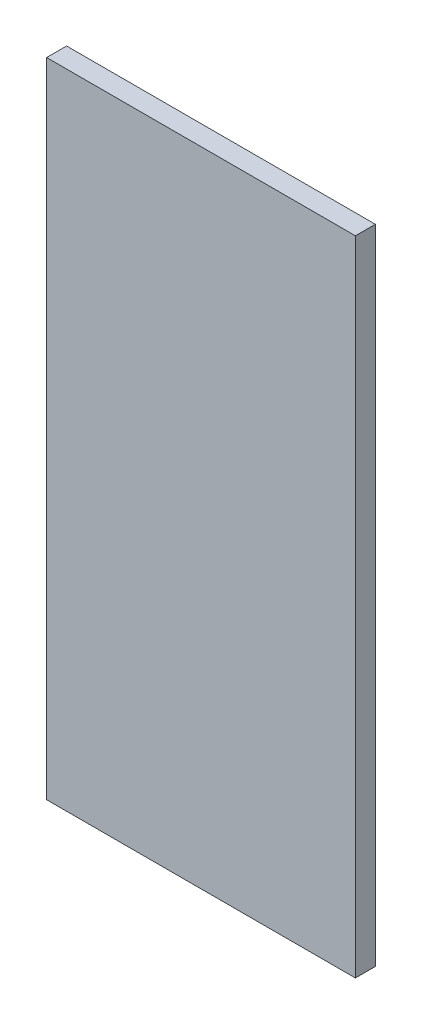
ISO-10303-21;
HEADER;
FILE_DESCRIPTION(('STEP AP214'),'2;1');
FILE_NAME('part.step','',(''),(''),'','','');
FILE_SCHEMA(('AUTOMOTIVE_DESIGN { 1 0 10303 214 1 1 1 1 }'));
ENDSEC;
DATA;
#1=APPLICATION_CONTEXT('core data for automotive mechanical design processes');
#2=APPLICATION_PROTOCOL_DEFINITION('international standard','automotive_design',2000,#1);
#3=PRODUCT_CONTEXT('',#1,'mechanical');
#4=PRODUCT('Part','Part','',(#3));
#5=PRODUCT_RELATED_PRODUCT_CATEGORY('part','',(#4));
#6=PRODUCT_DEFINITION_FORMATION('','',#4);
#7=PRODUCT_DEFINITION_CONTEXT('part definition',#1,'design');
#8=PRODUCT_DEFINITION('design','',#6,#7);
#9=PRODUCT_DEFINITION_SHAPE('','',#8);
#10=(LENGTH_UNIT() NAMED_UNIT(*) SI_UNIT(.MILLI.,.METRE.));
#11=(NAMED_UNIT(*) PLANE_ANGLE_UNIT() SI_UNIT($,.RADIAN.));
#12=(NAMED_UNIT(*) SI_UNIT($,.STERADIAN.) SOLID_ANGLE_UNIT());
#13=UNCERTAINTY_MEASURE_WITH_UNIT(LENGTH_MEASURE(1.E-05),#10,'distance_accuracy_value','');
#14=(GEOMETRIC_REPRESENTATION_CONTEXT(3) GLOBAL_UNCERTAINTY_ASSIGNED_CONTEXT((#13)) GLOBAL_UNIT_ASSIGNED_CONTEXT((#10,
#11,#12)) REPRESENTATION_CONTEXT('',''));
#15=CARTESIAN_POINT('',(0.,0.,0.));
#16=DIRECTION('',(0.,0.,1.));
#17=DIRECTION('',(1.,0.,0.));
#18=AXIS2_PLACEMENT_3D('',#15,#16,#17);
#19=CARTESIAN_POINT('',(91.0419998168945,102.857002258301,0.));
#20=DIRECTION('',(1.,0.,0.));
#21=DIRECTION('',(0.,-1.,0.));
#22=AXIS2_PLACEMENT_3D('',#19,#20,#21);
#23=PLANE('',#22);
#24=DIRECTION('',(0.,-1.,0.));
#25=VECTOR('',#24,1.);
#26=CARTESIAN_POINT('',(91.0419998168945,102.857002258301,0.03556));
#27=LINE('',#26,#25);
#28=CARTESIAN_POINT('',(91.0419998168945,102.857002258301,0.03556));
#29=VERTEX_POINT('',#28);
#30=CARTESIAN_POINT('',(91.0419998168945,101.71199798584,0.03556));
#31=VERTEX_POINT('',#30);
#32=EDGE_CURVE('E11',#29,#31,#27,.T.);
#33=ORIENTED_EDGE('',*,*,#32,.F.);
#34=DIRECTION('',(0.,0.,1.));
#35=VECTOR('',#34,1.);
#36=CARTESIAN_POINT('',(91.0419998168945,102.857002258301,0.));
#37=LINE('',#36,#35);
#38=CARTESIAN_POINT('',(91.0419998168945,102.857002258301,0.));
#39=VERTEX_POINT('',#38);
#40=EDGE_CURVE('E24',#39,#29,#37,.T.);
#41=ORIENTED_EDGE('',*,*,#40,.F.);
#42=DIRECTION('',(0.,-1.,0.));
#43=VECTOR('',#42,1.);
#44=CARTESIAN_POINT('',(91.0419998168945,102.857002258301,0.));
#45=LINE('',#44,#43);
#46=CARTESIAN_POINT('',(91.0419998168945,101.71199798584,0.));
#47=VERTEX_POINT('',#46);
#48=EDGE_CURVE('E75',#39,#47,#45,.T.);
#49=ORIENTED_EDGE('',*,*,#48,.T.);
#50=DIRECTION('',(0.,0.,1.));
#51=VECTOR('',#50,1.);
#52=CARTESIAN_POINT('',(91.0419998168945,101.71199798584,0.));
#53=LINE('',#52,#51);
#54=EDGE_CURVE('E37',#47,#31,#53,.T.);
#55=ORIENTED_EDGE('',*,*,#54,.T.);
#56=EDGE_LOOP('',(#33,#41,#49,#55));
#57=FACE_BOUND('',#56,.T.);
#58=ADVANCED_FACE('F17',(#57),#23,.F.);
#59=CARTESIAN_POINT('',(91.0419998168945,101.71199798584,0.));
#60=DIRECTION('',(0.,1.,0.));
#61=DIRECTION('',(1.,0.,0.));
#62=AXIS2_PLACEMENT_3D('',#59,#60,#61);
#63=PLANE('',#62);
#64=DIRECTION('',(1.,0.,0.));
#65=VECTOR('',#64,1.);
#66=CARTESIAN_POINT('',(91.0419998168945,101.71199798584,0.03556));
#67=LINE('',#66,#65);
#68=CARTESIAN_POINT('',(91.5920028686523,101.71199798584,0.03556));
#69=VERTEX_POINT('',#68);
#70=EDGE_CURVE('E83',#31,#69,#67,.T.);
#71=ORIENTED_EDGE('',*,*,#70,.F.);
#72=ORIENTED_EDGE('',*,*,#54,.F.);
#73=DIRECTION('',(1.,0.,0.));
#74=VECTOR('',#73,1.);
#75=CARTESIAN_POINT('',(91.0419998168945,101.71199798584,0.));
#76=LINE('',#75,#74);
#77=CARTESIAN_POINT('',(91.5920028686523,101.71199798584,0.));
#78=VERTEX_POINT('',#77);
#79=EDGE_CURVE('E81',#47,#78,#76,.T.);
#80=ORIENTED_EDGE('',*,*,#79,.T.);
#81=DIRECTION('',(0.,0.,1.));
#82=VECTOR('',#81,1.);
#83=CARTESIAN_POINT('',(91.5920028686523,101.71199798584,0.));
#84=LINE('',#83,#82);
#85=EDGE_CURVE('E67',#78,#69,#84,.T.);
#86=ORIENTED_EDGE('',*,*,#85,.T.);
#87=EDGE_LOOP('',(#71,#72,#80,#86));
#88=FACE_BOUND('',#87,.T.);
#89=ADVANCED_FACE('F89',(#88),#63,.F.);
#90=CARTESIAN_POINT('',(91.5920028686523,101.71199798584,0.));
#91=DIRECTION('',(-1.,0.,0.));
#92=DIRECTION('',(0.,1.,0.));
#93=AXIS2_PLACEMENT_3D('',#90,#91,#92);
#94=PLANE('',#93);
#95=DIRECTION('',(0.,1.,0.));
#96=VECTOR('',#95,1.);
#97=CARTESIAN_POINT('',(91.5920028686523,101.71199798584,0.03556));
#98=LINE('',#97,#96);
#99=CARTESIAN_POINT('',(91.5920028686523,102.857002258301,0.03556));
#100=VERTEX_POINT('',#99);
#101=EDGE_CURVE('E71',#69,#100,#98,.T.);
#102=ORIENTED_EDGE('',*,*,#101,.F.);
#103=ORIENTED_EDGE('',*,*,#85,.F.);
#104=DIRECTION('',(0.,1.,0.));
#105=VECTOR('',#104,1.);
#106=CARTESIAN_POINT('',(91.5920028686523,101.71199798584,0.));
#107=LINE('',#106,#105);
#108=CARTESIAN_POINT('',(91.5920028686523,102.857002258301,0.));
#109=VERTEX_POINT('',#108);
#110=EDGE_CURVE('E63',#78,#109,#107,.T.);
#111=ORIENTED_EDGE('',*,*,#110,.T.);
#112=DIRECTION('',(0.,0.,1.));
#113=VECTOR('',#112,1.);
#114=CARTESIAN_POINT('',(91.5920028686523,102.857002258301,0.));
#115=LINE('',#114,#113);
#116=EDGE_CURVE('E53',#109,#100,#115,.T.);
#117=ORIENTED_EDGE('',*,*,#116,.T.);
#118=EDGE_LOOP('',(#102,#103,#111,#117));
#119=FACE_BOUND('',#118,.T.);
#120=ADVANCED_FACE('F66',(#119),#94,.F.);
#121=CARTESIAN_POINT('',(91.5920028686523,102.857002258301,0.));
#122=DIRECTION('',(0.,-1.,0.));
#123=DIRECTION('',(-1.,0.,0.));
#124=AXIS2_PLACEMENT_3D('',#121,#122,#123);
#125=PLANE('',#124);
#126=DIRECTION('',(-1.,0.,0.));
#127=VECTOR('',#126,1.);
#128=CARTESIAN_POINT('',(91.5920028686523,102.857002258301,0.03556));
#129=LINE('',#128,#127);
#130=EDGE_CURVE('E59',#100,#29,#129,.T.);
#131=ORIENTED_EDGE('',*,*,#130,.F.);
#132=ORIENTED_EDGE('',*,*,#116,.F.);
#133=DIRECTION('',(-1.,0.,0.));
#134=VECTOR('',#133,1.);
#135=CARTESIAN_POINT('',(91.5920028686523,102.857002258301,0.));
#136=LINE('',#135,#134);
#137=EDGE_CURVE('E57',#109,#39,#136,.T.);
#138=ORIENTED_EDGE('',*,*,#137,.T.);
#139=ORIENTED_EDGE('',*,*,#40,.T.);
#140=EDGE_LOOP('',(#131,#132,#138,#139));
#141=FACE_BOUND('',#140,.T.);
#142=ADVANCED_FACE('F55',(#141),#125,.F.);
#143=CARTESIAN_POINT('',(91.0419998168945,102.857002258301,0.));
#144=DIRECTION('',(0.,0.,-1.));
#145=DIRECTION('',(-1.,0.,0.));
#146=AXIS2_PLACEMENT_3D('',#143,#144,#145);
#147=PLANE('',#146);
#148=ORIENTED_EDGE('',*,*,#137,.F.);
#149=ORIENTED_EDGE('',*,*,#110,.F.);
#150=ORIENTED_EDGE('',*,*,#79,.F.);
#151=ORIENTED_EDGE('',*,*,#48,.F.);
#152=EDGE_LOOP('',(#148,#149,#150,#151));
#153=FACE_BOUND('',#152,.T.);
#154=ADVANCED_FACE('F74',(#153),#147,.T.);
#155=CARTESIAN_POINT('',(91.0419998168945,102.857002258301,0.03556));
#156=DIRECTION('',(0.,0.,-1.));
#157=DIRECTION('',(-1.,0.,0.));
#158=AXIS2_PLACEMENT_3D('',#155,#156,#157);
#159=PLANE('',#158);
#160=ORIENTED_EDGE('',*,*,#32,.T.);
#161=ORIENTED_EDGE('',*,*,#70,.T.);
#162=ORIENTED_EDGE('',*,*,#101,.T.);
#163=ORIENTED_EDGE('',*,*,#130,.T.);
#164=EDGE_LOOP('',(#160,#161,#162,#163));
#165=FACE_BOUND('',#164,.T.);
#166=ADVANCED_FACE('F91',(#165),#159,.F.);
#167=CLOSED_SHELL('',(#58,#89,#120,#142,#154,#166));
#168=MANIFOLD_SOLID_BREP('B1',#167);
#169=ADVANCED_BREP_SHAPE_REPRESENTATION('',(#18,#168),#14);
#170=SHAPE_DEFINITION_REPRESENTATION(#9,#169);
ENDSEC;
END-ISO-10303-21;
